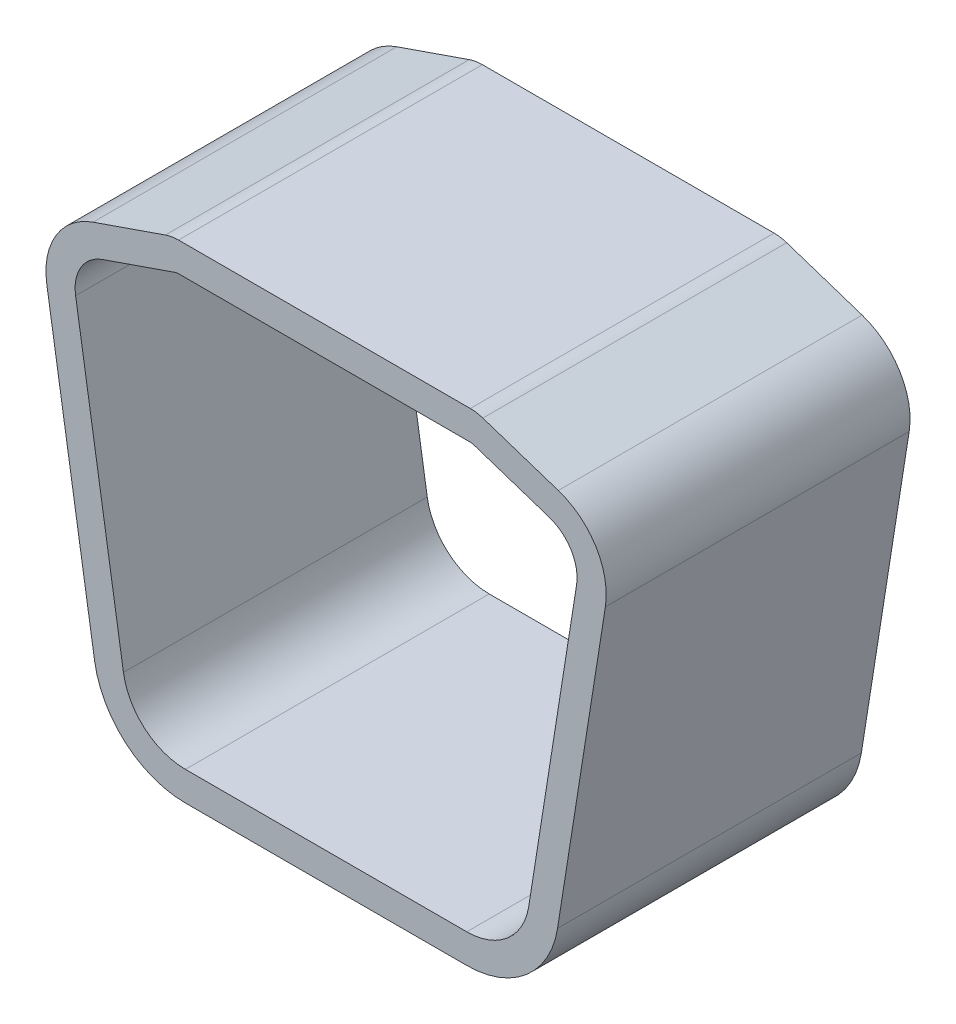
ISO-10303-21;
HEADER;
FILE_DESCRIPTION(('STEP AP214'),'2;1');
FILE_NAME('part.step','',(''),(''),'','','');
FILE_SCHEMA(('AUTOMOTIVE_DESIGN { 1 0 10303 214 1 1 1 1 }'));
ENDSEC;
DATA;
#1=APPLICATION_CONTEXT('core data for automotive mechanical design processes');
#2=APPLICATION_PROTOCOL_DEFINITION('international standard','automotive_design',2000,#1);
#3=PRODUCT_CONTEXT('',#1,'mechanical');
#4=PRODUCT('Part','Part','',(#3));
#5=PRODUCT_RELATED_PRODUCT_CATEGORY('part','',(#4));
#6=PRODUCT_DEFINITION_FORMATION('','',#4);
#7=PRODUCT_DEFINITION_CONTEXT('part definition',#1,'design');
#8=PRODUCT_DEFINITION('design','',#6,#7);
#9=PRODUCT_DEFINITION_SHAPE('','',#8);
#10=(LENGTH_UNIT() NAMED_UNIT(*) SI_UNIT(.MILLI.,.METRE.));
#11=(NAMED_UNIT(*) PLANE_ANGLE_UNIT() SI_UNIT($,.RADIAN.));
#12=(NAMED_UNIT(*) SI_UNIT($,.STERADIAN.) SOLID_ANGLE_UNIT());
#13=UNCERTAINTY_MEASURE_WITH_UNIT(LENGTH_MEASURE(1.E-05),#10,'distance_accuracy_value','');
#14=(GEOMETRIC_REPRESENTATION_CONTEXT(3) GLOBAL_UNCERTAINTY_ASSIGNED_CONTEXT((#13)) GLOBAL_UNIT_ASSIGNED_CONTEXT((#10,
#11,#12)) REPRESENTATION_CONTEXT('',''));
#15=CARTESIAN_POINT('',(0.,0.,0.));
#16=DIRECTION('',(0.,0.,1.));
#17=DIRECTION('',(1.,0.,0.));
#18=AXIS2_PLACEMENT_3D('',#15,#16,#17);
#19=CARTESIAN_POINT('',(12.2197985021854,22.9347964291513,27.6));
#20=DIRECTION('',(0.,0.,1.));
#21=DIRECTION('',(1.,0.,0.));
#22=AXIS2_PLACEMENT_3D('',#19,#20,#21);
#23=PLANE('',#22);
#24=CARTESIAN_POINT('',(12.2197985021854,22.9347964291513,27.6));
#25=DIRECTION('',(0.,0.,1.));
#26=DIRECTION('',(1.,0.,0.));
#27=AXIS2_PLACEMENT_3D('',#24,#25,#26);
#28=CIRCLE('',#27,3.65);
#29=CARTESIAN_POINT('',(13.366208682461,26.4000877154013,27.6));
#30=VERTEX_POINT('',#29);
#31=CARTESIAN_POINT('',(12.2197985021854,26.5847964291513,27.6));
#32=VERTEX_POINT('',#31);
#33=EDGE_CURVE('E289',#30,#32,#28,.T.);
#34=ORIENTED_EDGE('',*,*,#33,.T.);
#35=DIRECTION('',(-1.,0.,0.));
#36=VECTOR('',#35,1.);
#37=CARTESIAN_POINT('',(-14.2802014978146,26.5847964291513,27.6));
#38=LINE('',#37,#36);
#39=CARTESIAN_POINT('',(-14.2802014978146,26.5847964291513,27.6));
#40=VERTEX_POINT('',#39);
#41=EDGE_CURVE('E292',#32,#40,#38,.T.);
#42=ORIENTED_EDGE('',*,*,#41,.T.);
#43=CARTESIAN_POINT('',(-14.2802014978146,22.9347964291513,27.6));
#44=DIRECTION('',(0.,0.,1.));
#45=DIRECTION('',(1.,0.,0.));
#46=AXIS2_PLACEMENT_3D('',#43,#44,#45);
#47=CIRCLE('',#46,3.65);
#48=CARTESIAN_POINT('',(-15.4745830865024,26.3838474030576,27.6));
#49=VERTEX_POINT('',#48);
#50=EDGE_CURVE('E295',#40,#49,#47,.T.);
#51=ORIENTED_EDGE('',*,*,#50,.T.);
#52=DIRECTION('',(-0.944945472303089,-0.327227832517181,0.));
#53=VECTOR('',#52,1.);
#54=CARTESIAN_POINT('',(-22.0546999471926,24.1052001782759,27.6));
#55=LINE('',#54,#53);
#56=CARTESIAN_POINT('',(-22.0546999471926,24.1052001782759,27.6));
#57=VERTEX_POINT('',#56);
#58=EDGE_CURVE('E297',#49,#57,#55,.T.);
#59=ORIENTED_EDGE('',*,*,#58,.T.);
#60=CARTESIAN_POINT('',(-19.9768032107085,18.1047964291513,27.6));
#61=DIRECTION('',(0.,0.,1.));
#62=DIRECTION('',(1.,0.,0.));
#63=AXIS2_PLACEMENT_3D('',#60,#61,#62);
#64=CIRCLE('',#63,6.35);
#65=CARTESIAN_POINT('',(-26.2488113310943,17.1126199640935,27.6));
#66=VERTEX_POINT('',#65);
#67=EDGE_CURVE('E299',#57,#66,#64,.T.);
#68=ORIENTED_EDGE('',*,*,#67,.T.);
#69=DIRECTION('',(0.156248262213821,-0.987717814233985,0.));
#70=VECTOR('',#69,1.);
#71=CARTESIAN_POINT('',(-26.2488113310943,17.1126199640935,27.6));
#72=LINE('',#71,#70);
#73=CARTESIAN_POINT('',(-21.9042469595623,-10.3513886850146,27.6));
#74=VERTEX_POINT('',#73);
#75=EDGE_CURVE('E301',#66,#74,#72,.T.);
#76=ORIENTED_EDGE('',*,*,#75,.T.);
#77=CARTESIAN_POINT('',(-13.6568032107085,-9.04671569552916,27.6));
#78=DIRECTION('',(0.,0.,1.));
#79=DIRECTION('',(1.,0.,0.));
#80=AXIS2_PLACEMENT_3D('',#77,#78,#79);
#81=CIRCLE('',#80,8.34999999999998);
#82=CARTESIAN_POINT('',(-13.6568032107085,-17.3967156955291,27.6));
#83=VERTEX_POINT('',#82);
#84=EDGE_CURVE('E303',#74,#83,#81,.T.);
#85=ORIENTED_EDGE('',*,*,#84,.T.);
#86=DIRECTION('',(1.,0.,0.));
#87=VECTOR('',#86,1.);
#88=CARTESIAN_POINT('',(-13.6568032107085,-17.3967156955291,27.6));
#89=LINE('',#88,#87);
#90=CARTESIAN_POINT('',(11.9031967892915,-17.3967156955292,27.6));
#91=VERTEX_POINT('',#90);
#92=EDGE_CURVE('E305',#83,#91,#89,.T.);
#93=ORIENTED_EDGE('',*,*,#92,.T.);
#94=CARTESIAN_POINT('',(11.9031967892915,-9.04671569552916,27.6));
#95=DIRECTION('',(0.,0.,1.));
#96=DIRECTION('',(1.,0.,0.));
#97=AXIS2_PLACEMENT_3D('',#94,#95,#96);
#98=CIRCLE('',#97,8.35000000000001);
#99=CARTESIAN_POINT('',(20.1506405381453,-10.3513886850146,27.6));
#100=VERTEX_POINT('',#99);
#101=EDGE_CURVE('E307',#91,#100,#98,.T.);
#102=ORIENTED_EDGE('',*,*,#101,.T.);
#103=DIRECTION('',(0.15624826221382,0.987717814233985,0.));
#104=VECTOR('',#103,1.);
#105=CARTESIAN_POINT('',(24.4952049096773,17.1126199640935,27.6));
#106=LINE('',#105,#104);
#107=CARTESIAN_POINT('',(24.4952049096773,17.1126199640935,27.6));
#108=VERTEX_POINT('',#107);
#109=EDGE_CURVE('E309',#100,#108,#106,.T.);
#110=ORIENTED_EDGE('',*,*,#109,.T.);
#111=CARTESIAN_POINT('',(18.2231967892915,18.1047964291513,27.6));
#112=DIRECTION('',(0.,0.,1.));
#113=DIRECTION('',(1.,0.,0.));
#114=AXIS2_PLACEMENT_3D('',#111,#112,#113);
#115=CIRCLE('',#114,6.35000000000001);
#116=CARTESIAN_POINT('',(20.2176364179902,24.1334538723534,27.6));
#117=VERTEX_POINT('',#116);
#118=EDGE_CURVE('E311',#108,#117,#115,.T.);
#119=ORIENTED_EDGE('',*,*,#118,.T.);
#120=DIRECTION('',(-0.949394872945215,0.31408498089743,0.));
#121=VECTOR('',#120,1.);
#122=CARTESIAN_POINT('',(13.366208682461,26.4000877154013,27.6));
#123=LINE('',#122,#121);
#124=EDGE_CURVE('E313',#117,#30,#123,.T.);
#125=ORIENTED_EDGE('',*,*,#124,.T.);
#126=EDGE_LOOP('',(#34,#42,#51,#59,#68,#76,#85,#93,#102,#110,#119,#125));
#127=FACE_BOUND('',#126,.T.);
#128=DIRECTION('',(0.15624826221382,0.987717814233985,0.));
#129=VECTOR('',#128,1.);
#130=CARTESIAN_POINT('',(21.8777527019572,17.5266778589602,27.6));
#131=LINE('',#130,#129);
#132=CARTESIAN_POINT('',(17.5331883304252,-9.93733079014794,27.6));
#133=VERTEX_POINT('',#132);
#134=CARTESIAN_POINT('',(21.8777527019572,17.5266778589602,27.6));
#135=VERTEX_POINT('',#134);
#136=EDGE_CURVE('E204',#133,#135,#131,.T.);
#137=ORIENTED_EDGE('',*,*,#136,.F.);
#138=CARTESIAN_POINT('',(11.9031967892915,-9.04671569552916,27.6));
#139=DIRECTION('',(0.,0.,1.));
#140=DIRECTION('',(1.,0.,0.));
#141=AXIS2_PLACEMENT_3D('',#138,#139,#140);
#142=CIRCLE('',#141,5.7);
#143=CARTESIAN_POINT('',(11.9031967892915,-14.7467156955292,27.6));
#144=VERTEX_POINT('',#143);
#145=EDGE_CURVE('E196',#144,#133,#142,.T.);
#146=ORIENTED_EDGE('',*,*,#145,.F.);
#147=DIRECTION('',(1.,0.,0.));
#148=VECTOR('',#147,1.);
#149=CARTESIAN_POINT('',(-13.6568032107085,-14.7467156955291,27.6));
#150=LINE('',#149,#148);
#151=CARTESIAN_POINT('',(-13.6568032107085,-14.7467156955291,27.6));
#152=VERTEX_POINT('',#151);
#153=EDGE_CURVE('E237',#152,#144,#150,.T.);
#154=ORIENTED_EDGE('',*,*,#153,.F.);
#155=CARTESIAN_POINT('',(-13.6568032107085,-9.04671569552916,27.6));
#156=DIRECTION('',(0.,0.,1.));
#157=DIRECTION('',(1.,0.,0.));
#158=AXIS2_PLACEMENT_3D('',#155,#156,#157);
#159=CIRCLE('',#158,5.69999999999998);
#160=CARTESIAN_POINT('',(-19.2867947518422,-9.93733079014794,27.6));
#161=VERTEX_POINT('',#160);
#162=EDGE_CURVE('E235',#161,#152,#159,.T.);
#163=ORIENTED_EDGE('',*,*,#162,.F.);
#164=DIRECTION('',(0.156248262213821,-0.987717814233985,0.));
#165=VECTOR('',#164,1.);
#166=CARTESIAN_POINT('',(-23.6313591233743,17.5266778589602,27.6));
#167=LINE('',#166,#165);
#168=CARTESIAN_POINT('',(-23.6313591233743,17.5266778589602,27.6));
#169=VERTEX_POINT('',#168);
#170=EDGE_CURVE('E233',#169,#161,#167,.T.);
#171=ORIENTED_EDGE('',*,*,#170,.F.);
#172=CARTESIAN_POINT('',(-19.9768032107085,18.1047964291513,27.6));
#173=DIRECTION('',(0.,0.,1.));
#174=DIRECTION('',(1.,0.,0.));
#175=AXIS2_PLACEMENT_3D('',#172,#173,#174);
#176=CIRCLE('',#175,3.7);
#177=CARTESIAN_POINT('',(-21.1875461910221,21.6010946766727,27.6));
#178=VERTEX_POINT('',#177);
#179=EDGE_CURVE('E231',#178,#169,#176,.T.);
#180=ORIENTED_EDGE('',*,*,#179,.F.);
#181=DIRECTION('',(-0.944945472303089,-0.327227832517181,0.));
#182=VECTOR('',#181,1.);
#183=CARTESIAN_POINT('',(-21.1875461910221,21.6010946766727,27.6));
#184=LINE('',#183,#182);
#185=CARTESIAN_POINT('',(-14.6074293303318,23.8797419014544,27.6));
#186=VERTEX_POINT('',#185);
#187=EDGE_CURVE('E229',#186,#178,#184,.T.);
#188=ORIENTED_EDGE('',*,*,#187,.F.);
#189=CARTESIAN_POINT('',(-14.2802014978146,22.9347964291513,27.6));
#190=DIRECTION('',(0.,0.,1.));
#191=DIRECTION('',(1.,0.,0.));
#192=AXIS2_PLACEMENT_3D('',#189,#190,#191);
#193=CIRCLE('',#192,1.);
#194=CARTESIAN_POINT('',(-14.2802014978146,23.9347964291513,27.6));
#195=VERTEX_POINT('',#194);
#196=EDGE_CURVE('E227',#195,#186,#193,.T.);
#197=ORIENTED_EDGE('',*,*,#196,.F.);
#198=DIRECTION('',(-1.,0.,0.));
#199=VECTOR('',#198,1.);
#200=CARTESIAN_POINT('',(-14.2802014978146,23.9347964291513,27.6));
#201=LINE('',#200,#199);
#202=CARTESIAN_POINT('',(12.2197985021854,23.9347964291513,27.6));
#203=VERTEX_POINT('',#202);
#204=EDGE_CURVE('E225',#203,#195,#201,.T.);
#205=ORIENTED_EDGE('',*,*,#204,.F.);
#206=CARTESIAN_POINT('',(12.2197985021854,22.9347964291513,27.6));
#207=DIRECTION('',(0.,0.,1.));
#208=DIRECTION('',(1.,0.,0.));
#209=AXIS2_PLACEMENT_3D('',#206,#207,#208);
#210=CIRCLE('',#209,1.);
#211=CARTESIAN_POINT('',(12.5338834830828,23.8841913020965,27.6));
#212=VERTEX_POINT('',#211);
#213=EDGE_CURVE('E223',#212,#203,#210,.T.);
#214=ORIENTED_EDGE('',*,*,#213,.F.);
#215=DIRECTION('',(-0.949394872945215,0.31408498089743,0.));
#216=VECTOR('',#215,1.);
#217=CARTESIAN_POINT('',(12.5338834830828,23.8841913020965,27.6));
#218=LINE('',#217,#216);
#219=CARTESIAN_POINT('',(19.385311218612,21.6175574590486,27.6));
#220=VERTEX_POINT('',#219);
#221=EDGE_CURVE('E219',#220,#212,#218,.T.);
#222=ORIENTED_EDGE('',*,*,#221,.F.);
#223=CARTESIAN_POINT('',(18.2231967892915,18.1047964291513,27.6));
#224=DIRECTION('',(0.,0.,1.));
#225=DIRECTION('',(1.,0.,0.));
#226=AXIS2_PLACEMENT_3D('',#223,#224,#225);
#227=CIRCLE('',#226,3.70000000000001);
#228=EDGE_CURVE('E217',#135,#220,#227,.T.);
#229=ORIENTED_EDGE('',*,*,#228,.F.);
#230=EDGE_LOOP('',(#137,#146,#154,#163,#171,#180,#188,#197,#205,#214,#222,#229));
#231=FACE_BOUND('',#230,.T.);
#232=ADVANCED_FACE('F35',(#127,#231),#23,.T.);
#233=CARTESIAN_POINT('',(12.2197985021854,22.9347964291513,0.));
#234=DIRECTION('',(0.,0.,1.));
#235=DIRECTION('',(1.,0.,0.));
#236=AXIS2_PLACEMENT_3D('',#233,#234,#235);
#237=PLANE('',#236);
#238=CARTESIAN_POINT('',(12.2197985021854,22.9347964291513,0.));
#239=DIRECTION('',(0.,0.,1.));
#240=DIRECTION('',(1.,0.,0.));
#241=AXIS2_PLACEMENT_3D('',#238,#239,#240);
#242=CIRCLE('',#241,3.65);
#243=CARTESIAN_POINT('',(13.366208682461,26.4000877154013,0.));
#244=VERTEX_POINT('',#243);
#245=CARTESIAN_POINT('',(12.2197985021854,26.5847964291513,0.));
#246=VERTEX_POINT('',#245);
#247=EDGE_CURVE('E212',#244,#246,#242,.T.);
#248=ORIENTED_EDGE('',*,*,#247,.F.);
#249=DIRECTION('',(-0.949394872945215,0.31408498089743,0.));
#250=VECTOR('',#249,1.);
#251=CARTESIAN_POINT('',(13.366208682461,26.4000877154013,0.));
#252=LINE('',#251,#250);
#253=CARTESIAN_POINT('',(20.2176364179902,24.1334538723534,0.));
#254=VERTEX_POINT('',#253);
#255=EDGE_CURVE('E293',#254,#244,#252,.T.);
#256=ORIENTED_EDGE('',*,*,#255,.F.);
#257=CARTESIAN_POINT('',(18.2231967892915,18.1047964291513,0.));
#258=DIRECTION('',(0.,0.,1.));
#259=DIRECTION('',(1.,0.,0.));
#260=AXIS2_PLACEMENT_3D('',#257,#258,#259);
#261=CIRCLE('',#260,6.35000000000001);
#262=CARTESIAN_POINT('',(24.4952049096773,17.1126199640935,0.));
#263=VERTEX_POINT('',#262);
#264=EDGE_CURVE('E336',#263,#254,#261,.T.);
#265=ORIENTED_EDGE('',*,*,#264,.F.);
#266=DIRECTION('',(0.15624826221382,0.987717814233985,0.));
#267=VECTOR('',#266,1.);
#268=CARTESIAN_POINT('',(24.4952049096773,17.1126199640935,0.));
#269=LINE('',#268,#267);
#270=CARTESIAN_POINT('',(20.1506405381453,-10.3513886850146,0.));
#271=VERTEX_POINT('',#270);
#272=EDGE_CURVE('E334',#271,#263,#269,.T.);
#273=ORIENTED_EDGE('',*,*,#272,.F.);
#274=CARTESIAN_POINT('',(11.9031967892915,-9.04671569552916,0.));
#275=DIRECTION('',(0.,0.,1.));
#276=DIRECTION('',(1.,0.,0.));
#277=AXIS2_PLACEMENT_3D('',#274,#275,#276);
#278=CIRCLE('',#277,8.35000000000001);
#279=CARTESIAN_POINT('',(11.9031967892915,-17.3967156955292,0.));
#280=VERTEX_POINT('',#279);
#281=EDGE_CURVE('E332',#280,#271,#278,.T.);
#282=ORIENTED_EDGE('',*,*,#281,.F.);
#283=DIRECTION('',(1.,0.,0.));
#284=VECTOR('',#283,1.);
#285=CARTESIAN_POINT('',(-13.6568032107085,-17.3967156955291,0.));
#286=LINE('',#285,#284);
#287=CARTESIAN_POINT('',(-13.6568032107085,-17.3967156955291,0.));
#288=VERTEX_POINT('',#287);
#289=EDGE_CURVE('E330',#288,#280,#286,.T.);
#290=ORIENTED_EDGE('',*,*,#289,.F.);
#291=CARTESIAN_POINT('',(-13.6568032107085,-9.04671569552916,0.));
#292=DIRECTION('',(0.,0.,1.));
#293=DIRECTION('',(1.,0.,0.));
#294=AXIS2_PLACEMENT_3D('',#291,#292,#293);
#295=CIRCLE('',#294,8.34999999999998);
#296=CARTESIAN_POINT('',(-21.9042469595623,-10.3513886850146,0.));
#297=VERTEX_POINT('',#296);
#298=EDGE_CURVE('E328',#297,#288,#295,.T.);
#299=ORIENTED_EDGE('',*,*,#298,.F.);
#300=DIRECTION('',(0.156248262213821,-0.987717814233985,0.));
#301=VECTOR('',#300,1.);
#302=CARTESIAN_POINT('',(-26.2488113310943,17.1126199640935,0.));
#303=LINE('',#302,#301);
#304=CARTESIAN_POINT('',(-26.2488113310943,17.1126199640935,0.));
#305=VERTEX_POINT('',#304);
#306=EDGE_CURVE('E326',#305,#297,#303,.T.);
#307=ORIENTED_EDGE('',*,*,#306,.F.);
#308=CARTESIAN_POINT('',(-19.9768032107085,18.1047964291513,0.));
#309=DIRECTION('',(0.,0.,1.));
#310=DIRECTION('',(1.,0.,0.));
#311=AXIS2_PLACEMENT_3D('',#308,#309,#310);
#312=CIRCLE('',#311,6.35);
#313=CARTESIAN_POINT('',(-22.0546999471926,24.1052001782759,0.));
#314=VERTEX_POINT('',#313);
#315=EDGE_CURVE('E324',#314,#305,#312,.T.);
#316=ORIENTED_EDGE('',*,*,#315,.F.);
#317=DIRECTION('',(-0.944945472303089,-0.327227832517181,0.));
#318=VECTOR('',#317,1.);
#319=CARTESIAN_POINT('',(-22.0546999471926,24.1052001782759,0.));
#320=LINE('',#319,#318);
#321=CARTESIAN_POINT('',(-15.4745830865024,26.3838474030576,0.));
#322=VERTEX_POINT('',#321);
#323=EDGE_CURVE('E322',#322,#314,#320,.T.);
#324=ORIENTED_EDGE('',*,*,#323,.F.);
#325=CARTESIAN_POINT('',(-14.2802014978146,22.9347964291513,0.));
#326=DIRECTION('',(0.,0.,1.));
#327=DIRECTION('',(1.,0.,0.));
#328=AXIS2_PLACEMENT_3D('',#325,#326,#327);
#329=CIRCLE('',#328,3.65);
#330=CARTESIAN_POINT('',(-14.2802014978146,26.5847964291513,0.));
#331=VERTEX_POINT('',#330);
#332=EDGE_CURVE('E320',#331,#322,#329,.T.);
#333=ORIENTED_EDGE('',*,*,#332,.F.);
#334=DIRECTION('',(-1.,0.,0.));
#335=VECTOR('',#334,1.);
#336=CARTESIAN_POINT('',(-14.2802014978146,26.5847964291513,0.));
#337=LINE('',#336,#335);
#338=EDGE_CURVE('E318',#246,#331,#337,.T.);
#339=ORIENTED_EDGE('',*,*,#338,.F.);
#340=EDGE_LOOP('',(#248,#256,#265,#273,#282,#290,#299,#307,#316,#324,#333,#339));
#341=FACE_BOUND('',#340,.T.);
#342=CARTESIAN_POINT('',(11.9031967892915,-9.04671569552916,0.));
#343=DIRECTION('',(0.,0.,1.));
#344=DIRECTION('',(1.,0.,0.));
#345=AXIS2_PLACEMENT_3D('',#342,#343,#344);
#346=CIRCLE('',#345,5.7);
#347=CARTESIAN_POINT('',(11.9031967892915,-14.7467156955292,0.));
#348=VERTEX_POINT('',#347);
#349=CARTESIAN_POINT('',(17.5331883304252,-9.93733079014794,0.));
#350=VERTEX_POINT('',#349);
#351=EDGE_CURVE('E58',#348,#350,#346,.T.);
#352=ORIENTED_EDGE('',*,*,#351,.T.);
#353=DIRECTION('',(0.15624826221382,0.987717814233985,0.));
#354=VECTOR('',#353,1.);
#355=CARTESIAN_POINT('',(21.8777527019572,17.5266778589602,0.));
#356=LINE('',#355,#354);
#357=CARTESIAN_POINT('',(21.8777527019572,17.5266778589602,0.));
#358=VERTEX_POINT('',#357);
#359=EDGE_CURVE('E211',#350,#358,#356,.T.);
#360=ORIENTED_EDGE('',*,*,#359,.T.);
#361=CARTESIAN_POINT('',(18.2231967892915,18.1047964291513,0.));
#362=DIRECTION('',(0.,0.,1.));
#363=DIRECTION('',(1.,0.,0.));
#364=AXIS2_PLACEMENT_3D('',#361,#362,#363);
#365=CIRCLE('',#364,3.70000000000001);
#366=CARTESIAN_POINT('',(19.385311218612,21.6175574590486,0.));
#367=VERTEX_POINT('',#366);
#368=EDGE_CURVE('E241',#358,#367,#365,.T.);
#369=ORIENTED_EDGE('',*,*,#368,.T.);
#370=DIRECTION('',(-0.949394872945215,0.31408498089743,0.));
#371=VECTOR('',#370,1.);
#372=CARTESIAN_POINT('',(12.5338834830828,23.8841913020965,0.));
#373=LINE('',#372,#371);
#374=CARTESIAN_POINT('',(12.5338834830828,23.8841913020965,0.));
#375=VERTEX_POINT('',#374);
#376=EDGE_CURVE('E244',#367,#375,#373,.T.);
#377=ORIENTED_EDGE('',*,*,#376,.T.);
#378=CARTESIAN_POINT('',(12.2197985021854,22.9347964291513,0.));
#379=DIRECTION('',(0.,0.,1.));
#380=DIRECTION('',(1.,0.,0.));
#381=AXIS2_PLACEMENT_3D('',#378,#379,#380);
#382=CIRCLE('',#381,1.);
#383=CARTESIAN_POINT('',(12.2197985021854,23.9347964291513,0.));
#384=VERTEX_POINT('',#383);
#385=EDGE_CURVE('E247',#375,#384,#382,.T.);
#386=ORIENTED_EDGE('',*,*,#385,.T.);
#387=DIRECTION('',(-1.,0.,0.));
#388=VECTOR('',#387,1.);
#389=CARTESIAN_POINT('',(-14.2802014978146,23.9347964291513,0.));
#390=LINE('',#389,#388);
#391=CARTESIAN_POINT('',(-14.2802014978146,23.9347964291513,0.));
#392=VERTEX_POINT('',#391);
#393=EDGE_CURVE('E250',#384,#392,#390,.T.);
#394=ORIENTED_EDGE('',*,*,#393,.T.);
#395=CARTESIAN_POINT('',(-14.2802014978146,22.9347964291513,0.));
#396=DIRECTION('',(0.,0.,1.));
#397=DIRECTION('',(1.,0.,0.));
#398=AXIS2_PLACEMENT_3D('',#395,#396,#397);
#399=CIRCLE('',#398,1.);
#400=CARTESIAN_POINT('',(-14.6074293303318,23.8797419014544,0.));
#401=VERTEX_POINT('',#400);
#402=EDGE_CURVE('E253',#392,#401,#399,.T.);
#403=ORIENTED_EDGE('',*,*,#402,.T.);
#404=DIRECTION('',(-0.944945472303089,-0.327227832517181,0.));
#405=VECTOR('',#404,1.);
#406=CARTESIAN_POINT('',(-21.1875461910221,21.6010946766727,0.));
#407=LINE('',#406,#405);
#408=CARTESIAN_POINT('',(-21.1875461910221,21.6010946766727,0.));
#409=VERTEX_POINT('',#408);
#410=EDGE_CURVE('E256',#401,#409,#407,.T.);
#411=ORIENTED_EDGE('',*,*,#410,.T.);
#412=CARTESIAN_POINT('',(-19.9768032107085,18.1047964291513,0.));
#413=DIRECTION('',(0.,0.,1.));
#414=DIRECTION('',(1.,0.,0.));
#415=AXIS2_PLACEMENT_3D('',#412,#413,#414);
#416=CIRCLE('',#415,3.7);
#417=CARTESIAN_POINT('',(-23.6313591233743,17.5266778589602,0.));
#418=VERTEX_POINT('',#417);
#419=EDGE_CURVE('E259',#409,#418,#416,.T.);
#420=ORIENTED_EDGE('',*,*,#419,.T.);
#421=DIRECTION('',(0.156248262213821,-0.987717814233985,0.));
#422=VECTOR('',#421,1.);
#423=CARTESIAN_POINT('',(-23.6313591233743,17.5266778589602,0.));
#424=LINE('',#423,#422);
#425=CARTESIAN_POINT('',(-19.2867947518422,-9.93733079014794,0.));
#426=VERTEX_POINT('',#425);
#427=EDGE_CURVE('E262',#418,#426,#424,.T.);
#428=ORIENTED_EDGE('',*,*,#427,.T.);
#429=CARTESIAN_POINT('',(-13.6568032107085,-9.04671569552916,0.));
#430=DIRECTION('',(0.,0.,1.));
#431=DIRECTION('',(1.,0.,0.));
#432=AXIS2_PLACEMENT_3D('',#429,#430,#431);
#433=CIRCLE('',#432,5.69999999999998);
#434=CARTESIAN_POINT('',(-13.6568032107085,-14.7467156955291,0.));
#435=VERTEX_POINT('',#434);
#436=EDGE_CURVE('E265',#426,#435,#433,.T.);
#437=ORIENTED_EDGE('',*,*,#436,.T.);
#438=DIRECTION('',(1.,0.,0.));
#439=VECTOR('',#438,1.);
#440=CARTESIAN_POINT('',(-13.6568032107085,-14.7467156955291,0.));
#441=LINE('',#440,#439);
#442=EDGE_CURVE('E205',#435,#348,#441,.T.);
#443=ORIENTED_EDGE('',*,*,#442,.T.);
#444=EDGE_LOOP('',(#352,#360,#369,#377,#386,#394,#403,#411,#420,#428,#437,#443));
#445=FACE_BOUND('',#444,.T.);
#446=ADVANCED_FACE('F378',(#341,#445),#237,.F.);
#447=CARTESIAN_POINT('',(12.2197985021854,22.9347964291513,27.6));
#448=DIRECTION('',(0.,0.,-1.));
#449=DIRECTION('',(-1.,0.,0.));
#450=AXIS2_PLACEMENT_3D('',#447,#448,#449);
#451=CYLINDRICAL_SURFACE('',#450,3.65);
#452=ORIENTED_EDGE('',*,*,#247,.T.);
#453=DIRECTION('',(0.,0.,-1.));
#454=VECTOR('',#453,1.);
#455=CARTESIAN_POINT('',(12.2197985021854,26.5847964291513,27.6));
#456=LINE('',#455,#454);
#457=EDGE_CURVE('E11',#32,#246,#456,.T.);
#458=ORIENTED_EDGE('',*,*,#457,.F.);
#459=ORIENTED_EDGE('',*,*,#33,.F.);
#460=DIRECTION('',(0.,0.,-1.));
#461=VECTOR('',#460,1.);
#462=CARTESIAN_POINT('',(13.366208682461,26.4000877154013,27.6));
#463=LINE('',#462,#461);
#464=EDGE_CURVE('E315',#30,#244,#463,.T.);
#465=ORIENTED_EDGE('',*,*,#464,.T.);
#466=EDGE_LOOP('',(#452,#458,#459,#465));
#467=FACE_BOUND('',#466,.T.);
#468=ADVANCED_FACE('F37',(#467),#451,.T.);
#469=CARTESIAN_POINT('',(-14.2802014978146,26.5847964291513,27.6));
#470=DIRECTION('',(0.,-1.,0.));
#471=DIRECTION('',(0.,0.,-1.));
#472=AXIS2_PLACEMENT_3D('',#469,#470,#471);
#473=PLANE('',#472);
#474=ORIENTED_EDGE('',*,*,#338,.T.);
#475=DIRECTION('',(0.,0.,-1.));
#476=VECTOR('',#475,1.);
#477=CARTESIAN_POINT('',(-14.2802014978146,26.5847964291513,27.6));
#478=LINE('',#477,#476);
#479=EDGE_CURVE('E43',#40,#331,#478,.T.);
#480=ORIENTED_EDGE('',*,*,#479,.F.);
#481=ORIENTED_EDGE('',*,*,#41,.F.);
#482=ORIENTED_EDGE('',*,*,#457,.T.);
#483=EDGE_LOOP('',(#474,#480,#481,#482));
#484=FACE_BOUND('',#483,.T.);
#485=ADVANCED_FACE('F395',(#484),#473,.F.);
#486=CARTESIAN_POINT('',(-14.2802014978146,22.9347964291513,27.6));
#487=DIRECTION('',(0.,0.,-1.));
#488=DIRECTION('',(-1.,0.,0.));
#489=AXIS2_PLACEMENT_3D('',#486,#487,#488);
#490=CYLINDRICAL_SURFACE('',#489,3.65);
#491=ORIENTED_EDGE('',*,*,#332,.T.);
#492=DIRECTION('',(0.,0.,-1.));
#493=VECTOR('',#492,1.);
#494=CARTESIAN_POINT('',(-15.4745830865024,26.3838474030576,27.6));
#495=LINE('',#494,#493);
#496=EDGE_CURVE('E365',#49,#322,#495,.T.);
#497=ORIENTED_EDGE('',*,*,#496,.F.);
#498=ORIENTED_EDGE('',*,*,#50,.F.);
#499=ORIENTED_EDGE('',*,*,#479,.T.);
#500=EDGE_LOOP('',(#491,#497,#498,#499));
#501=FACE_BOUND('',#500,.T.);
#502=ADVANCED_FACE('F372',(#501),#490,.T.);
#503=CARTESIAN_POINT('',(-22.0546999471926,24.1052001782759,27.6));
#504=DIRECTION('',(0.327227832517181,-0.944945472303089,0.));
#505=DIRECTION('',(0.944945472303089,0.327227832517181,0.));
#506=AXIS2_PLACEMENT_3D('',#503,#504,#505);
#507=PLANE('',#506);
#508=ORIENTED_EDGE('',*,*,#323,.T.);
#509=DIRECTION('',(0.,0.,-1.));
#510=VECTOR('',#509,1.);
#511=CARTESIAN_POINT('',(-22.0546999471926,24.1052001782759,27.6));
#512=LINE('',#511,#510);
#513=EDGE_CURVE('E362',#57,#314,#512,.T.);
#514=ORIENTED_EDGE('',*,*,#513,.F.);
#515=ORIENTED_EDGE('',*,*,#58,.F.);
#516=ORIENTED_EDGE('',*,*,#496,.T.);
#517=EDGE_LOOP('',(#508,#514,#515,#516));
#518=FACE_BOUND('',#517,.T.);
#519=ADVANCED_FACE('F384',(#518),#507,.F.);
#520=CARTESIAN_POINT('',(-19.9768032107085,18.1047964291513,27.6));
#521=DIRECTION('',(0.,0.,-1.));
#522=DIRECTION('',(-1.,0.,0.));
#523=AXIS2_PLACEMENT_3D('',#520,#521,#522);
#524=CYLINDRICAL_SURFACE('',#523,6.35);
#525=ORIENTED_EDGE('',*,*,#315,.T.);
#526=DIRECTION('',(0.,0.,-1.));
#527=VECTOR('',#526,1.);
#528=CARTESIAN_POINT('',(-26.2488113310943,17.1126199640935,27.6));
#529=LINE('',#528,#527);
#530=EDGE_CURVE('E359',#66,#305,#529,.T.);
#531=ORIENTED_EDGE('',*,*,#530,.F.);
#532=ORIENTED_EDGE('',*,*,#67,.F.);
#533=ORIENTED_EDGE('',*,*,#513,.T.);
#534=EDGE_LOOP('',(#525,#531,#532,#533));
#535=FACE_BOUND('',#534,.T.);
#536=ADVANCED_FACE('F388',(#535),#524,.T.);
#537=CARTESIAN_POINT('',(-26.2488113310943,17.1126199640935,27.6));
#538=DIRECTION('',(0.987717814233985,0.156248262213821,0.));
#539=DIRECTION('',(-0.156248262213821,0.987717814233985,0.));
#540=AXIS2_PLACEMENT_3D('',#537,#538,#539);
#541=PLANE('',#540);
#542=ORIENTED_EDGE('',*,*,#306,.T.);
#543=DIRECTION('',(0.,0.,-1.));
#544=VECTOR('',#543,1.);
#545=CARTESIAN_POINT('',(-21.9042469595623,-10.3513886850146,27.6));
#546=LINE('',#545,#544);
#547=EDGE_CURVE('E356',#74,#297,#546,.T.);
#548=ORIENTED_EDGE('',*,*,#547,.F.);
#549=ORIENTED_EDGE('',*,*,#75,.F.);
#550=ORIENTED_EDGE('',*,*,#530,.T.);
#551=EDGE_LOOP('',(#542,#548,#549,#550));
#552=FACE_BOUND('',#551,.T.);
#553=ADVANCED_FACE('F428',(#552),#541,.F.);
#554=CARTESIAN_POINT('',(-13.6568032107085,-9.04671569552916,27.6));
#555=DIRECTION('',(0.,0.,-1.));
#556=DIRECTION('',(-1.,0.,0.));
#557=AXIS2_PLACEMENT_3D('',#554,#555,#556);
#558=CYLINDRICAL_SURFACE('',#557,8.34999999999998);
#559=ORIENTED_EDGE('',*,*,#298,.T.);
#560=DIRECTION('',(0.,0.,-1.));
#561=VECTOR('',#560,1.);
#562=CARTESIAN_POINT('',(-13.6568032107085,-17.3967156955291,27.6));
#563=LINE('',#562,#561);
#564=EDGE_CURVE('E353',#83,#288,#563,.T.);
#565=ORIENTED_EDGE('',*,*,#564,.F.);
#566=ORIENTED_EDGE('',*,*,#84,.F.);
#567=ORIENTED_EDGE('',*,*,#547,.T.);
#568=EDGE_LOOP('',(#559,#565,#566,#567));
#569=FACE_BOUND('',#568,.T.);
#570=ADVANCED_FACE('F426',(#569),#558,.T.);
#571=CARTESIAN_POINT('',(-13.6568032107085,-17.3967156955291,27.6));
#572=DIRECTION('',(0.,1.,0.));
#573=DIRECTION('',(-1.,0.,0.));
#574=AXIS2_PLACEMENT_3D('',#571,#572,#573);
#575=PLANE('',#574);
#576=ORIENTED_EDGE('',*,*,#289,.T.);
#577=DIRECTION('',(0.,0.,-1.));
#578=VECTOR('',#577,1.);
#579=CARTESIAN_POINT('',(11.9031967892915,-17.3967156955292,27.6));
#580=LINE('',#579,#578);
#581=EDGE_CURVE('E350',#91,#280,#580,.T.);
#582=ORIENTED_EDGE('',*,*,#581,.F.);
#583=ORIENTED_EDGE('',*,*,#92,.F.);
#584=ORIENTED_EDGE('',*,*,#564,.T.);
#585=EDGE_LOOP('',(#576,#582,#583,#584));
#586=FACE_BOUND('',#585,.T.);
#587=ADVANCED_FACE('F422',(#586),#575,.F.);
#588=CARTESIAN_POINT('',(11.9031967892915,-9.04671569552916,27.6));
#589=DIRECTION('',(0.,0.,-1.));
#590=DIRECTION('',(-1.,0.,0.));
#591=AXIS2_PLACEMENT_3D('',#588,#589,#590);
#592=CYLINDRICAL_SURFACE('',#591,8.35000000000001);
#593=ORIENTED_EDGE('',*,*,#281,.T.);
#594=DIRECTION('',(0.,0.,-1.));
#595=VECTOR('',#594,1.);
#596=CARTESIAN_POINT('',(20.1506405381453,-10.3513886850146,27.6));
#597=LINE('',#596,#595);
#598=EDGE_CURVE('E347',#100,#271,#597,.T.);
#599=ORIENTED_EDGE('',*,*,#598,.F.);
#600=ORIENTED_EDGE('',*,*,#101,.F.);
#601=ORIENTED_EDGE('',*,*,#581,.T.);
#602=EDGE_LOOP('',(#593,#599,#600,#601));
#603=FACE_BOUND('',#602,.T.);
#604=ADVANCED_FACE('F417',(#603),#592,.T.);
#605=CARTESIAN_POINT('',(24.4952049096773,17.1126199640935,27.6));
#606=DIRECTION('',(-0.987717814233985,0.15624826221382,0.));
#607=DIRECTION('',(-0.15624826221382,-0.987717814233985,0.));
#608=AXIS2_PLACEMENT_3D('',#605,#606,#607);
#609=PLANE('',#608);
#610=ORIENTED_EDGE('',*,*,#272,.T.);
#611=DIRECTION('',(0.,0.,-1.));
#612=VECTOR('',#611,1.);
#613=CARTESIAN_POINT('',(24.4952049096773,17.1126199640935,27.6));
#614=LINE('',#613,#612);
#615=EDGE_CURVE('E344',#108,#263,#614,.T.);
#616=ORIENTED_EDGE('',*,*,#615,.F.);
#617=ORIENTED_EDGE('',*,*,#109,.F.);
#618=ORIENTED_EDGE('',*,*,#598,.T.);
#619=EDGE_LOOP('',(#610,#616,#617,#618));
#620=FACE_BOUND('',#619,.T.);
#621=ADVANCED_FACE('F411',(#620),#609,.F.);
#622=CARTESIAN_POINT('',(18.2231967892915,18.1047964291513,27.6));
#623=DIRECTION('',(0.,0.,-1.));
#624=DIRECTION('',(-1.,0.,0.));
#625=AXIS2_PLACEMENT_3D('',#622,#623,#624);
#626=CYLINDRICAL_SURFACE('',#625,6.35000000000001);
#627=ORIENTED_EDGE('',*,*,#264,.T.);
#628=DIRECTION('',(0.,0.,-1.));
#629=VECTOR('',#628,1.);
#630=CARTESIAN_POINT('',(20.2176364179902,24.1334538723534,27.6));
#631=LINE('',#630,#629);
#632=EDGE_CURVE('E341',#117,#254,#631,.T.);
#633=ORIENTED_EDGE('',*,*,#632,.F.);
#634=ORIENTED_EDGE('',*,*,#118,.F.);
#635=ORIENTED_EDGE('',*,*,#615,.T.);
#636=EDGE_LOOP('',(#627,#633,#634,#635));
#637=FACE_BOUND('',#636,.T.);
#638=ADVANCED_FACE('F407',(#637),#626,.T.);
#639=CARTESIAN_POINT('',(13.366208682461,26.4000877154013,27.6));
#640=DIRECTION('',(-0.31408498089743,-0.949394872945215,0.));
#641=DIRECTION('',(0.949394872945215,-0.31408498089743,0.));
#642=AXIS2_PLACEMENT_3D('',#639,#640,#641);
#643=PLANE('',#642);
#644=ORIENTED_EDGE('',*,*,#255,.T.);
#645=ORIENTED_EDGE('',*,*,#464,.F.);
#646=ORIENTED_EDGE('',*,*,#124,.F.);
#647=ORIENTED_EDGE('',*,*,#632,.T.);
#648=EDGE_LOOP('',(#644,#645,#646,#647));
#649=FACE_BOUND('',#648,.T.);
#650=ADVANCED_FACE('F402',(#649),#643,.F.);
#651=CARTESIAN_POINT('',(11.9031967892915,-9.04671569552916,27.6));
#652=DIRECTION('',(0.,0.,-1.));
#653=DIRECTION('',(-1.,0.,0.));
#654=AXIS2_PLACEMENT_3D('',#651,#652,#653);
#655=CYLINDRICAL_SURFACE('',#654,5.7);
#656=ORIENTED_EDGE('',*,*,#351,.F.);
#657=DIRECTION('',(0.,0.,-1.));
#658=VECTOR('',#657,1.);
#659=CARTESIAN_POINT('',(11.9031967892915,-14.7467156955292,27.6));
#660=LINE('',#659,#658);
#661=EDGE_CURVE('E200',#144,#348,#660,.T.);
#662=ORIENTED_EDGE('',*,*,#661,.F.);
#663=ORIENTED_EDGE('',*,*,#145,.T.);
#664=DIRECTION('',(0.,0.,-1.));
#665=VECTOR('',#664,1.);
#666=CARTESIAN_POINT('',(17.5331883304252,-9.93733079014794,27.6));
#667=LINE('',#666,#665);
#668=EDGE_CURVE('E199',#133,#350,#667,.T.);
#669=ORIENTED_EDGE('',*,*,#668,.T.);
#670=EDGE_LOOP('',(#656,#662,#663,#669));
#671=FACE_BOUND('',#670,.T.);
#672=ADVANCED_FACE('F198',(#671),#655,.F.);
#673=CARTESIAN_POINT('',(21.8777527019572,17.5266778589602,27.6));
#674=DIRECTION('',(-0.987717814233985,0.15624826221382,0.));
#675=DIRECTION('',(-0.15624826221382,-0.987717814233985,0.));
#676=AXIS2_PLACEMENT_3D('',#673,#674,#675);
#677=PLANE('',#676);
#678=ORIENTED_EDGE('',*,*,#359,.F.);
#679=ORIENTED_EDGE('',*,*,#668,.F.);
#680=ORIENTED_EDGE('',*,*,#136,.T.);
#681=DIRECTION('',(0.,0.,-1.));
#682=VECTOR('',#681,1.);
#683=CARTESIAN_POINT('',(21.8777527019572,17.5266778589602,27.6));
#684=LINE('',#683,#682);
#685=EDGE_CURVE('E213',#135,#358,#684,.T.);
#686=ORIENTED_EDGE('',*,*,#685,.T.);
#687=EDGE_LOOP('',(#678,#679,#680,#686));
#688=FACE_BOUND('',#687,.T.);
#689=ADVANCED_FACE('F208',(#688),#677,.T.);
#690=CARTESIAN_POINT('',(18.2231967892915,18.1047964291513,27.6));
#691=DIRECTION('',(0.,0.,-1.));
#692=DIRECTION('',(-1.,0.,0.));
#693=AXIS2_PLACEMENT_3D('',#690,#691,#692);
#694=CYLINDRICAL_SURFACE('',#693,3.70000000000001);
#695=ORIENTED_EDGE('',*,*,#368,.F.);
#696=ORIENTED_EDGE('',*,*,#685,.F.);
#697=ORIENTED_EDGE('',*,*,#228,.T.);
#698=DIRECTION('',(0.,0.,-1.));
#699=VECTOR('',#698,1.);
#700=CARTESIAN_POINT('',(19.385311218612,21.6175574590486,27.6));
#701=LINE('',#700,#699);
#702=EDGE_CURVE('E286',#220,#367,#701,.T.);
#703=ORIENTED_EDGE('',*,*,#702,.T.);
#704=EDGE_LOOP('',(#695,#696,#697,#703));
#705=FACE_BOUND('',#704,.T.);
#706=ADVANCED_FACE('F486',(#705),#694,.F.);
#707=CARTESIAN_POINT('',(12.5338834830828,23.8841913020965,27.6));
#708=DIRECTION('',(-0.31408498089743,-0.949394872945215,0.));
#709=DIRECTION('',(0.949394872945215,-0.31408498089743,0.));
#710=AXIS2_PLACEMENT_3D('',#707,#708,#709);
#711=PLANE('',#710);
#712=ORIENTED_EDGE('',*,*,#376,.F.);
#713=ORIENTED_EDGE('',*,*,#702,.F.);
#714=ORIENTED_EDGE('',*,*,#221,.T.);
#715=DIRECTION('',(0.,0.,-1.));
#716=VECTOR('',#715,1.);
#717=CARTESIAN_POINT('',(12.5338834830828,23.8841913020965,27.6));
#718=LINE('',#717,#716);
#719=EDGE_CURVE('E284',#212,#375,#718,.T.);
#720=ORIENTED_EDGE('',*,*,#719,.T.);
#721=EDGE_LOOP('',(#712,#713,#714,#720));
#722=FACE_BOUND('',#721,.T.);
#723=ADVANCED_FACE('F492',(#722),#711,.T.);
#724=CARTESIAN_POINT('',(12.2197985021854,22.9347964291513,27.6));
#725=DIRECTION('',(0.,0.,-1.));
#726=DIRECTION('',(-1.,0.,0.));
#727=AXIS2_PLACEMENT_3D('',#724,#725,#726);
#728=CYLINDRICAL_SURFACE('',#727,1.);
#729=ORIENTED_EDGE('',*,*,#385,.F.);
#730=ORIENTED_EDGE('',*,*,#719,.F.);
#731=ORIENTED_EDGE('',*,*,#213,.T.);
#732=DIRECTION('',(0.,0.,-1.));
#733=VECTOR('',#732,1.);
#734=CARTESIAN_POINT('',(12.2197985021854,23.9347964291513,27.6));
#735=LINE('',#734,#733);
#736=EDGE_CURVE('E282',#203,#384,#735,.T.);
#737=ORIENTED_EDGE('',*,*,#736,.T.);
#738=EDGE_LOOP('',(#729,#730,#731,#737));
#739=FACE_BOUND('',#738,.T.);
#740=ADVANCED_FACE('F500',(#739),#728,.F.);
#741=CARTESIAN_POINT('',(-14.2802014978146,23.9347964291513,27.6));
#742=DIRECTION('',(0.,-1.,0.));
#743=DIRECTION('',(1.,0.,0.));
#744=AXIS2_PLACEMENT_3D('',#741,#742,#743);
#745=PLANE('',#744);
#746=ORIENTED_EDGE('',*,*,#393,.F.);
#747=ORIENTED_EDGE('',*,*,#736,.F.);
#748=ORIENTED_EDGE('',*,*,#204,.T.);
#749=DIRECTION('',(0.,0.,-1.));
#750=VECTOR('',#749,1.);
#751=CARTESIAN_POINT('',(-14.2802014978146,23.9347964291513,27.6));
#752=LINE('',#751,#750);
#753=EDGE_CURVE('E280',#195,#392,#752,.T.);
#754=ORIENTED_EDGE('',*,*,#753,.T.);
#755=EDGE_LOOP('',(#746,#747,#748,#754));
#756=FACE_BOUND('',#755,.T.);
#757=ADVANCED_FACE('F508',(#756),#745,.T.);
#758=CARTESIAN_POINT('',(-14.2802014978146,22.9347964291513,27.6));
#759=DIRECTION('',(0.,0.,-1.));
#760=DIRECTION('',(-1.,0.,0.));
#761=AXIS2_PLACEMENT_3D('',#758,#759,#760);
#762=CYLINDRICAL_SURFACE('',#761,1.);
#763=ORIENTED_EDGE('',*,*,#402,.F.);
#764=ORIENTED_EDGE('',*,*,#753,.F.);
#765=ORIENTED_EDGE('',*,*,#196,.T.);
#766=DIRECTION('',(0.,0.,-1.));
#767=VECTOR('',#766,1.);
#768=CARTESIAN_POINT('',(-14.6074293303318,23.8797419014544,27.6));
#769=LINE('',#768,#767);
#770=EDGE_CURVE('E278',#186,#401,#769,.T.);
#771=ORIENTED_EDGE('',*,*,#770,.T.);
#772=EDGE_LOOP('',(#763,#764,#765,#771));
#773=FACE_BOUND('',#772,.T.);
#774=ADVANCED_FACE('F516',(#773),#762,.F.);
#775=CARTESIAN_POINT('',(-21.1875461910221,21.6010946766727,27.6));
#776=DIRECTION('',(0.327227832517181,-0.944945472303089,0.));
#777=DIRECTION('',(0.944945472303089,0.327227832517181,0.));
#778=AXIS2_PLACEMENT_3D('',#775,#776,#777);
#779=PLANE('',#778);
#780=ORIENTED_EDGE('',*,*,#410,.F.);
#781=ORIENTED_EDGE('',*,*,#770,.F.);
#782=ORIENTED_EDGE('',*,*,#187,.T.);
#783=DIRECTION('',(0.,0.,-1.));
#784=VECTOR('',#783,1.);
#785=CARTESIAN_POINT('',(-21.1875461910221,21.6010946766727,27.6));
#786=LINE('',#785,#784);
#787=EDGE_CURVE('E276',#178,#409,#786,.T.);
#788=ORIENTED_EDGE('',*,*,#787,.T.);
#789=EDGE_LOOP('',(#780,#781,#782,#788));
#790=FACE_BOUND('',#789,.T.);
#791=ADVANCED_FACE('F524',(#790),#779,.T.);
#792=CARTESIAN_POINT('',(-19.9768032107085,18.1047964291513,27.6));
#793=DIRECTION('',(0.,0.,-1.));
#794=DIRECTION('',(-1.,0.,0.));
#795=AXIS2_PLACEMENT_3D('',#792,#793,#794);
#796=CYLINDRICAL_SURFACE('',#795,3.7);
#797=ORIENTED_EDGE('',*,*,#419,.F.);
#798=ORIENTED_EDGE('',*,*,#787,.F.);
#799=ORIENTED_EDGE('',*,*,#179,.T.);
#800=DIRECTION('',(0.,0.,-1.));
#801=VECTOR('',#800,1.);
#802=CARTESIAN_POINT('',(-23.6313591233743,17.5266778589602,27.6));
#803=LINE('',#802,#801);
#804=EDGE_CURVE('E274',#169,#418,#803,.T.);
#805=ORIENTED_EDGE('',*,*,#804,.T.);
#806=EDGE_LOOP('',(#797,#798,#799,#805));
#807=FACE_BOUND('',#806,.T.);
#808=ADVANCED_FACE('F532',(#807),#796,.F.);
#809=CARTESIAN_POINT('',(-23.6313591233743,17.5266778589602,27.6));
#810=DIRECTION('',(0.987717814233985,0.156248262213821,0.));
#811=DIRECTION('',(-0.156248262213821,0.987717814233985,0.));
#812=AXIS2_PLACEMENT_3D('',#809,#810,#811);
#813=PLANE('',#812);
#814=ORIENTED_EDGE('',*,*,#427,.F.);
#815=ORIENTED_EDGE('',*,*,#804,.F.);
#816=ORIENTED_EDGE('',*,*,#170,.T.);
#817=DIRECTION('',(0.,0.,-1.));
#818=VECTOR('',#817,1.);
#819=CARTESIAN_POINT('',(-19.2867947518422,-9.93733079014794,27.6));
#820=LINE('',#819,#818);
#821=EDGE_CURVE('E272',#161,#426,#820,.T.);
#822=ORIENTED_EDGE('',*,*,#821,.T.);
#823=EDGE_LOOP('',(#814,#815,#816,#822));
#824=FACE_BOUND('',#823,.T.);
#825=ADVANCED_FACE('F540',(#824),#813,.T.);
#826=CARTESIAN_POINT('',(-13.6568032107085,-9.04671569552916,27.6));
#827=DIRECTION('',(0.,0.,-1.));
#828=DIRECTION('',(-1.,0.,0.));
#829=AXIS2_PLACEMENT_3D('',#826,#827,#828);
#830=CYLINDRICAL_SURFACE('',#829,5.69999999999998);
#831=ORIENTED_EDGE('',*,*,#436,.F.);
#832=ORIENTED_EDGE('',*,*,#821,.F.);
#833=ORIENTED_EDGE('',*,*,#162,.T.);
#834=DIRECTION('',(0.,0.,-1.));
#835=VECTOR('',#834,1.);
#836=CARTESIAN_POINT('',(-13.6568032107085,-14.7467156955291,27.6));
#837=LINE('',#836,#835);
#838=EDGE_CURVE('E50',#152,#435,#837,.T.);
#839=ORIENTED_EDGE('',*,*,#838,.T.);
#840=EDGE_LOOP('',(#831,#832,#833,#839));
#841=FACE_BOUND('',#840,.T.);
#842=ADVANCED_FACE('F548',(#841),#830,.F.);
#843=CARTESIAN_POINT('',(-13.6568032107085,-14.7467156955291,27.6));
#844=DIRECTION('',(0.,1.,0.));
#845=DIRECTION('',(-1.,0.,0.));
#846=AXIS2_PLACEMENT_3D('',#843,#844,#845);
#847=PLANE('',#846);
#848=ORIENTED_EDGE('',*,*,#442,.F.);
#849=ORIENTED_EDGE('',*,*,#838,.F.);
#850=ORIENTED_EDGE('',*,*,#153,.T.);
#851=ORIENTED_EDGE('',*,*,#661,.T.);
#852=EDGE_LOOP('',(#848,#849,#850,#851));
#853=FACE_BOUND('',#852,.T.);
#854=ADVANCED_FACE('F556',(#853),#847,.T.);
#855=CLOSED_SHELL('',(#232,#446,#468,#485,#502,#519,#536,#553,#570,#587,#604,#621,#638,#650,
#672,#689,#706,#723,#740,#757,#774,#791,#808,#825,#842,#854));
#856=MANIFOLD_SOLID_BREP('B2',#855);
#857=ADVANCED_BREP_SHAPE_REPRESENTATION('',(#18,#856),#14);
#858=SHAPE_DEFINITION_REPRESENTATION(#9,#857);
ENDSEC;
END-ISO-10303-21;
